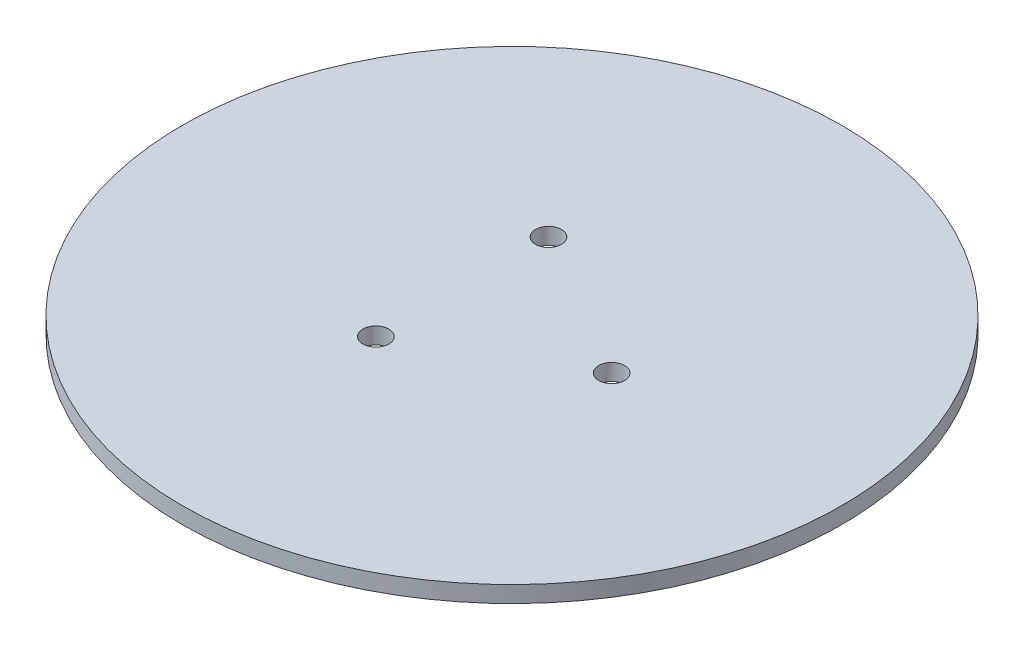
ISO-10303-21;
HEADER;
FILE_DESCRIPTION(('STEP AP214'),'2;1');
FILE_NAME('part.step','',(''),(''),'','','');
FILE_SCHEMA(('AUTOMOTIVE_DESIGN { 1 0 10303 214 1 1 1 1 }'));
ENDSEC;
DATA;
#1=APPLICATION_CONTEXT('core data for automotive mechanical design processes');
#2=APPLICATION_PROTOCOL_DEFINITION('international standard','automotive_design',2000,#1);
#3=PRODUCT_CONTEXT('',#1,'mechanical');
#4=PRODUCT('Part','Part','',(#3));
#5=PRODUCT_RELATED_PRODUCT_CATEGORY('part','',(#4));
#6=PRODUCT_DEFINITION_FORMATION('','',#4);
#7=PRODUCT_DEFINITION_CONTEXT('part definition',#1,'design');
#8=PRODUCT_DEFINITION('design','',#6,#7);
#9=PRODUCT_DEFINITION_SHAPE('','',#8);
#10=(LENGTH_UNIT() NAMED_UNIT(*) SI_UNIT(.MILLI.,.METRE.));
#11=(NAMED_UNIT(*) PLANE_ANGLE_UNIT() SI_UNIT($,.RADIAN.));
#12=(NAMED_UNIT(*) SI_UNIT($,.STERADIAN.) SOLID_ANGLE_UNIT());
#13=UNCERTAINTY_MEASURE_WITH_UNIT(LENGTH_MEASURE(1.E-05),#10,'distance_accuracy_value','');
#14=(GEOMETRIC_REPRESENTATION_CONTEXT(3) GLOBAL_UNCERTAINTY_ASSIGNED_CONTEXT((#13)) GLOBAL_UNIT_ASSIGNED_CONTEXT((#10,
#11,#12)) REPRESENTATION_CONTEXT('',''));
#15=CARTESIAN_POINT('',(0.,0.,0.));
#16=DIRECTION('',(0.,0.,1.));
#17=DIRECTION('',(1.,0.,0.));
#18=AXIS2_PLACEMENT_3D('',#15,#16,#17);
#19=CARTESIAN_POINT('',(0.,3.175,0.));
#20=DIRECTION('',(0.,1.,0.));
#21=DIRECTION('',(0.,0.,1.));
#22=AXIS2_PLACEMENT_3D('',#19,#20,#21);
#23=PLANE('',#22);
#24=CARTESIAN_POINT('',(-9.60000000000008,3.175,-16.6276877526612));
#25=DIRECTION('',(0.,1.,0.));
#26=DIRECTION('',(0.,0.,1.));
#27=AXIS2_PLACEMENT_3D('',#24,#25,#26);
#28=CIRCLE('',#27,2.5);
#29=CARTESIAN_POINT('',(-9.60000000000008,3.175,-14.1276877526612));
#30=VERTEX_POINT('',#29);
#31=EDGE_CURVE('E47',#30,#30,#28,.T.);
#32=ORIENTED_EDGE('',*,*,#31,.F.);
#33=EDGE_LOOP('',(#32));
#34=FACE_BOUND('',#33,.T.);
#35=CARTESIAN_POINT('',(0.,3.175,0.));
#36=DIRECTION('',(0.,1.,0.));
#37=DIRECTION('',(0.,0.,1.));
#38=AXIS2_PLACEMENT_3D('',#35,#36,#37);
#39=CIRCLE('',#38,63.5);
#40=CARTESIAN_POINT('',(0.,3.175,63.5));
#41=VERTEX_POINT('',#40);
#42=EDGE_CURVE('E10',#41,#41,#39,.T.);
#43=ORIENTED_EDGE('',*,*,#42,.T.);
#44=EDGE_LOOP('',(#43));
#45=FACE_BOUND('',#44,.T.);
#46=CARTESIAN_POINT('',(19.2,3.175,0.));
#47=DIRECTION('',(0.,1.,0.));
#48=DIRECTION('',(0.,0.,1.));
#49=AXIS2_PLACEMENT_3D('',#46,#47,#48);
#50=CIRCLE('',#49,2.5);
#51=CARTESIAN_POINT('',(19.2,3.175,2.5));
#52=VERTEX_POINT('',#51);
#53=EDGE_CURVE('E42',#52,#52,#50,.T.);
#54=ORIENTED_EDGE('',*,*,#53,.F.);
#55=EDGE_LOOP('',(#54));
#56=FACE_BOUND('',#55,.T.);
#57=CARTESIAN_POINT('',(-9.59999999999985,3.175,16.6276877526613));
#58=DIRECTION('',(0.,1.,0.));
#59=DIRECTION('',(0.,0.,1.));
#60=AXIS2_PLACEMENT_3D('',#57,#58,#59);
#61=CIRCLE('',#60,2.5);
#62=CARTESIAN_POINT('',(-9.59999999999985,3.175,19.1276877526613));
#63=VERTEX_POINT('',#62);
#64=EDGE_CURVE('E53',#63,#63,#61,.T.);
#65=ORIENTED_EDGE('',*,*,#64,.F.);
#66=EDGE_LOOP('',(#65));
#67=FACE_BOUND('',#66,.T.);
#68=ADVANCED_FACE('F31',(#34,#45,#56,#67),#23,.T.);
#69=CARTESIAN_POINT('',(0.,0.,0.));
#70=DIRECTION('',(0.,1.,0.));
#71=DIRECTION('',(0.,0.,1.));
#72=AXIS2_PLACEMENT_3D('',#69,#70,#71);
#73=PLANE('',#72);
#74=CARTESIAN_POINT('',(0.,0.,0.));
#75=DIRECTION('',(0.,1.,0.));
#76=DIRECTION('',(0.,0.,1.));
#77=AXIS2_PLACEMENT_3D('',#74,#75,#76);
#78=CIRCLE('',#77,63.5);
#79=CARTESIAN_POINT('',(0.,0.,63.5));
#80=VERTEX_POINT('',#79);
#81=EDGE_CURVE('E35',#80,#80,#78,.T.);
#82=ORIENTED_EDGE('',*,*,#81,.F.);
#83=EDGE_LOOP('',(#82));
#84=FACE_BOUND('',#83,.T.);
#85=CARTESIAN_POINT('',(19.2,0.,0.));
#86=DIRECTION('',(0.,1.,0.));
#87=DIRECTION('',(0.,0.,1.));
#88=AXIS2_PLACEMENT_3D('',#85,#86,#87);
#89=CIRCLE('',#88,2.5);
#90=CARTESIAN_POINT('',(19.2,0.,2.5));
#91=VERTEX_POINT('',#90);
#92=EDGE_CURVE('E44',#91,#91,#89,.T.);
#93=ORIENTED_EDGE('',*,*,#92,.T.);
#94=EDGE_LOOP('',(#93));
#95=FACE_BOUND('',#94,.T.);
#96=CARTESIAN_POINT('',(-9.60000000000008,0.,-16.6276877526612));
#97=DIRECTION('',(0.,1.,0.));
#98=DIRECTION('',(0.,0.,1.));
#99=AXIS2_PLACEMENT_3D('',#96,#97,#98);
#100=CIRCLE('',#99,2.5);
#101=CARTESIAN_POINT('',(-9.60000000000008,0.,-14.1276877526612));
#102=VERTEX_POINT('',#101);
#103=EDGE_CURVE('E50',#102,#102,#100,.T.);
#104=ORIENTED_EDGE('',*,*,#103,.T.);
#105=EDGE_LOOP('',(#104));
#106=FACE_BOUND('',#105,.T.);
#107=CARTESIAN_POINT('',(-9.59999999999985,0.,16.6276877526613));
#108=DIRECTION('',(0.,1.,0.));
#109=DIRECTION('',(0.,0.,1.));
#110=AXIS2_PLACEMENT_3D('',#107,#108,#109);
#111=CIRCLE('',#110,2.5);
#112=CARTESIAN_POINT('',(-9.59999999999985,0.,19.1276877526613));
#113=VERTEX_POINT('',#112);
#114=EDGE_CURVE('E56',#113,#113,#111,.T.);
#115=ORIENTED_EDGE('',*,*,#114,.T.);
#116=EDGE_LOOP('',(#115));
#117=FACE_BOUND('',#116,.T.);
#118=ADVANCED_FACE('F66',(#84,#95,#106,#117),#73,.F.);
#119=CARTESIAN_POINT('',(0.,3.175,0.));
#120=DIRECTION('',(0.,-1.,0.));
#121=DIRECTION('',(0.,0.,-1.));
#122=AXIS2_PLACEMENT_3D('',#119,#120,#121);
#123=CYLINDRICAL_SURFACE('',#122,63.5);
#124=ORIENTED_EDGE('',*,*,#42,.F.);
#125=EDGE_LOOP('',(#124));
#126=FACE_BOUND('',#125,.T.);
#127=ORIENTED_EDGE('',*,*,#81,.T.);
#128=EDGE_LOOP('',(#127));
#129=FACE_BOUND('',#128,.T.);
#130=ADVANCED_FACE('F33',(#126,#129),#123,.T.);
#131=CARTESIAN_POINT('',(19.2,3.175,0.));
#132=DIRECTION('',(0.,-1.,0.));
#133=DIRECTION('',(0.,0.,-1.));
#134=AXIS2_PLACEMENT_3D('',#131,#132,#133);
#135=CYLINDRICAL_SURFACE('',#134,2.5);
#136=ORIENTED_EDGE('',*,*,#53,.T.);
#137=EDGE_LOOP('',(#136));
#138=FACE_BOUND('',#137,.T.);
#139=ORIENTED_EDGE('',*,*,#92,.F.);
#140=EDGE_LOOP('',(#139));
#141=FACE_BOUND('',#140,.T.);
#142=ADVANCED_FACE('F75',(#138,#141),#135,.F.);
#143=CARTESIAN_POINT('',(-9.60000000000008,3.175,-16.6276877526612));
#144=DIRECTION('',(0.,-1.,0.));
#145=DIRECTION('',(0.,0.,-1.));
#146=AXIS2_PLACEMENT_3D('',#143,#144,#145);
#147=CYLINDRICAL_SURFACE('',#146,2.5);
#148=ORIENTED_EDGE('',*,*,#31,.T.);
#149=EDGE_LOOP('',(#148));
#150=FACE_BOUND('',#149,.T.);
#151=ORIENTED_EDGE('',*,*,#103,.F.);
#152=EDGE_LOOP('',(#151));
#153=FACE_BOUND('',#152,.T.);
#154=ADVANCED_FACE('F78',(#150,#153),#147,.F.);
#155=CARTESIAN_POINT('',(-9.59999999999985,3.175,16.6276877526613));
#156=DIRECTION('',(0.,-1.,0.));
#157=DIRECTION('',(0.,0.,-1.));
#158=AXIS2_PLACEMENT_3D('',#155,#156,#157);
#159=CYLINDRICAL_SURFACE('',#158,2.5);
#160=ORIENTED_EDGE('',*,*,#64,.T.);
#161=EDGE_LOOP('',(#160));
#162=FACE_BOUND('',#161,.T.);
#163=ORIENTED_EDGE('',*,*,#114,.F.);
#164=EDGE_LOOP('',(#163));
#165=FACE_BOUND('',#164,.T.);
#166=ADVANCED_FACE('F62',(#162,#165),#159,.F.);
#167=CLOSED_SHELL('',(#68,#118,#130,#142,#154,#166));
#168=MANIFOLD_SOLID_BREP('B2',#167);
#169=ADVANCED_BREP_SHAPE_REPRESENTATION('',(#18,#168),#14);
#170=SHAPE_DEFINITION_REPRESENTATION(#9,#169);
ENDSEC;
END-ISO-10303-21;
